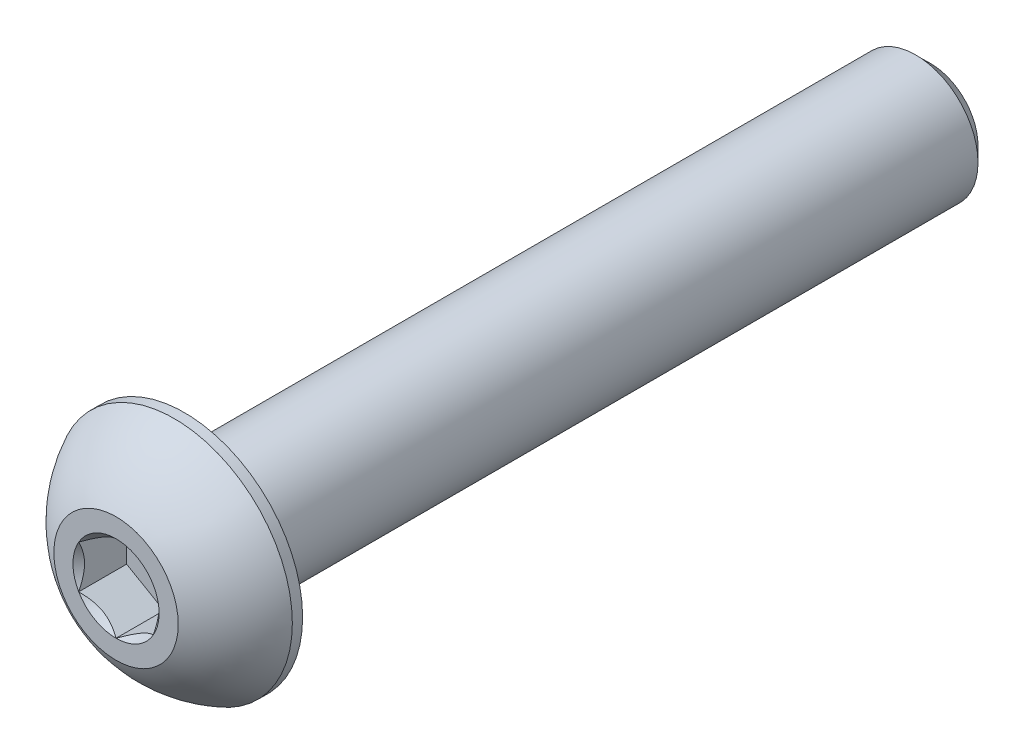
ISO-10303-21;
HEADER;
FILE_DESCRIPTION(('STEP AP214'),'2;1');
FILE_NAME('part.step','',(''),(''),'','','');
FILE_SCHEMA(('AUTOMOTIVE_DESIGN { 1 0 10303 214 1 1 1 1 }'));
ENDSEC;
DATA;
#1=APPLICATION_CONTEXT('core data for automotive mechanical design processes');
#2=APPLICATION_PROTOCOL_DEFINITION('international standard','automotive_design',2000,#1);
#3=PRODUCT_CONTEXT('',#1,'mechanical');
#4=PRODUCT('Part','Part','',(#3));
#5=PRODUCT_RELATED_PRODUCT_CATEGORY('part','',(#4));
#6=PRODUCT_DEFINITION_FORMATION('','',#4);
#7=PRODUCT_DEFINITION_CONTEXT('part definition',#1,'design');
#8=PRODUCT_DEFINITION('design','',#6,#7);
#9=PRODUCT_DEFINITION_SHAPE('','',#8);
#10=(LENGTH_UNIT() NAMED_UNIT(*) SI_UNIT(.MILLI.,.METRE.));
#11=(NAMED_UNIT(*) PLANE_ANGLE_UNIT() SI_UNIT($,.RADIAN.));
#12=(NAMED_UNIT(*) SI_UNIT($,.STERADIAN.) SOLID_ANGLE_UNIT());
#13=UNCERTAINTY_MEASURE_WITH_UNIT(LENGTH_MEASURE(1.E-05),#10,'distance_accuracy_value','');
#14=(GEOMETRIC_REPRESENTATION_CONTEXT(3) GLOBAL_UNCERTAINTY_ASSIGNED_CONTEXT((#13)) GLOBAL_UNIT_ASSIGNED_CONTEXT((#10,
#11,#12)) REPRESENTATION_CONTEXT('',''));
#15=CARTESIAN_POINT('',(0.,0.,0.));
#16=DIRECTION('',(0.,0.,1.));
#17=DIRECTION('',(1.,0.,0.));
#18=AXIS2_PLACEMENT_3D('',#15,#16,#17);
#19=CARTESIAN_POINT('',(0.,0.,-32.75));
#20=DIRECTION('',(0.,0.,1.));
#21=DIRECTION('',(1.,0.,0.));
#22=AXIS2_PLACEMENT_3D('',#19,#20,#21);
#23=PLANE('',#22);
#24=CARTESIAN_POINT('',(0.,0.,-32.75));
#25=DIRECTION('',(0.,0.,1.));
#26=DIRECTION('',(1.,0.,0.));
#27=AXIS2_PLACEMENT_3D('',#24,#25,#26);
#28=CIRCLE('',#27,1.9);
#29=CARTESIAN_POINT('',(1.9,0.,-32.75));
#30=VERTEX_POINT('',#29);
#31=EDGE_CURVE('E55',#30,#30,#28,.T.);
#32=ORIENTED_EDGE('',*,*,#31,.F.);
#33=EDGE_LOOP('',(#32));
#34=FACE_BOUND('',#33,.T.);
#35=ADVANCED_FACE('F41',(#34),#23,.F.);
#36=CARTESIAN_POINT('',(0.,0.,-32.75));
#37=DIRECTION('',(0.,0.,1.));
#38=DIRECTION('',(1.,0.,0.));
#39=AXIS2_PLACEMENT_3D('',#36,#37,#38);
#40=CONICAL_SURFACE('',#39,1.9,0.785398163397446);
#41=CARTESIAN_POINT('',(0.,0.,-32.15));
#42=DIRECTION('',(0.,0.,1.));
#43=DIRECTION('',(1.,0.,0.));
#44=AXIS2_PLACEMENT_3D('',#41,#42,#43);
#45=CIRCLE('',#44,2.5);
#46=CARTESIAN_POINT('',(2.5,0.,-32.15));
#47=VERTEX_POINT('',#46);
#48=EDGE_CURVE('E198',#47,#47,#45,.T.);
#49=ORIENTED_EDGE('',*,*,#48,.F.);
#50=EDGE_LOOP('',(#49));
#51=FACE_BOUND('',#50,.T.);
#52=ORIENTED_EDGE('',*,*,#31,.T.);
#53=EDGE_LOOP('',(#52));
#54=FACE_BOUND('',#53,.T.);
#55=ADVANCED_FACE('F205',(#51,#54),#40,.T.);
#56=CARTESIAN_POINT('',(0.,0.,0.));
#57=DIRECTION('',(0.,0.,1.));
#58=DIRECTION('',(1.,0.,0.));
#59=AXIS2_PLACEMENT_3D('',#56,#57,#58);
#60=CYLINDRICAL_SURFACE('',#59,2.50000000000001);
#61=CARTESIAN_POINT('',(0.,0.,-2.75));
#62=DIRECTION('',(0.,0.,1.));
#63=DIRECTION('',(1.,0.,0.));
#64=AXIS2_PLACEMENT_3D('',#61,#62,#63);
#65=CIRCLE('',#64,2.50000000000001);
#66=CARTESIAN_POINT('',(2.50000000000001,0.,-2.75));
#67=VERTEX_POINT('',#66);
#68=EDGE_CURVE('E194',#67,#67,#65,.T.);
#69=ORIENTED_EDGE('',*,*,#68,.F.);
#70=EDGE_LOOP('',(#69));
#71=FACE_BOUND('',#70,.T.);
#72=ORIENTED_EDGE('',*,*,#48,.T.);
#73=EDGE_LOOP('',(#72));
#74=FACE_BOUND('',#73,.T.);
#75=ADVANCED_FACE('F211',(#71,#74),#60,.T.);
#76=CARTESIAN_POINT('',(0.,-4.75,-2.75));
#77=DIRECTION('',(0.,0.,1.));
#78=DIRECTION('',(1.,0.,0.));
#79=AXIS2_PLACEMENT_3D('',#76,#77,#78);
#80=PLANE('',#79);
#81=CARTESIAN_POINT('',(0.,0.,-2.75));
#82=DIRECTION('',(0.,0.,1.));
#83=DIRECTION('',(1.,0.,0.));
#84=AXIS2_PLACEMENT_3D('',#81,#82,#83);
#85=CIRCLE('',#84,4.75);
#86=CARTESIAN_POINT('',(4.75,0.,-2.75));
#87=VERTEX_POINT('',#86);
#88=EDGE_CURVE('E186',#87,#87,#85,.T.);
#89=ORIENTED_EDGE('',*,*,#88,.F.);
#90=EDGE_LOOP('',(#89));
#91=FACE_BOUND('',#90,.T.);
#92=ORIENTED_EDGE('',*,*,#68,.T.);
#93=EDGE_LOOP('',(#92));
#94=FACE_BOUND('',#93,.T.);
#95=ADVANCED_FACE('F216',(#91,#94),#80,.F.);
#96=CARTESIAN_POINT('',(0.,0.,-4.65805481283422));
#97=DIRECTION('',(0.,0.,1.));
#98=DIRECTION('',(0.,-1.,0.));
#99=AXIS2_PLACEMENT_3D('',#96,#97,#98);
#100=SPHERICAL_SURFACE('',#99,5.28653711226623);
#101=CARTESIAN_POINT('',(0.,0.,0.));
#102=DIRECTION('',(0.,0.,1.));
#103=DIRECTION('',(1.,0.,0.));
#104=AXIS2_PLACEMENT_3D('',#101,#102,#103);
#105=CIRCLE('',#104,2.50000000000001);
#106=CARTESIAN_POINT('',(2.50000000000001,0.,0.));
#107=VERTEX_POINT('',#106);
#108=EDGE_CURVE('E190',#107,#107,#105,.T.);
#109=ORIENTED_EDGE('',*,*,#108,.F.);
#110=EDGE_LOOP('',(#109));
#111=FACE_BOUND('',#110,.T.);
#112=CARTESIAN_POINT('',(0.,0.,-2.3375));
#113=DIRECTION('',(0.,0.,1.));
#114=DIRECTION('',(1.,0.,0.));
#115=AXIS2_PLACEMENT_3D('',#112,#113,#114);
#116=CIRCLE('',#115,4.75);
#117=CARTESIAN_POINT('',(4.75,0.,-2.3375));
#118=VERTEX_POINT('',#117);
#119=EDGE_CURVE('E182',#118,#118,#116,.T.);
#120=ORIENTED_EDGE('',*,*,#119,.T.);
#121=EDGE_LOOP('',(#120));
#122=FACE_BOUND('',#121,.T.);
#123=ADVANCED_FACE('F221',(#111,#122),#100,.T.);
#124=CARTESIAN_POINT('',(0.,-2.50000000000001,0.));
#125=DIRECTION('',(0.,0.,-1.));
#126=DIRECTION('',(-1.,0.,0.));
#127=AXIS2_PLACEMENT_3D('',#124,#125,#126);
#128=PLANE('',#127);
#129=CARTESIAN_POINT('',(0.,0.,0.));
#130=DIRECTION('',(0.,0.,1.));
#131=DIRECTION('',(1.,0.,0.));
#132=AXIS2_PLACEMENT_3D('',#129,#130,#131);
#133=CIRCLE('',#132,1.73205080756888);
#134=CARTESIAN_POINT('',(-1.5,0.866025403784438,0.));
#135=VERTEX_POINT('',#134);
#136=CARTESIAN_POINT('',(-1.5,-0.866025403784439,0.));
#137=VERTEX_POINT('',#136);
#138=EDGE_CURVE('E68',#135,#137,#133,.T.);
#139=ORIENTED_EDGE('',*,*,#138,.F.);
#140=CARTESIAN_POINT('',(0.,1.73205080756888,0.));
#141=VERTEX_POINT('',#140);
#142=EDGE_CURVE('E145',#141,#135,#133,.T.);
#143=ORIENTED_EDGE('',*,*,#142,.F.);
#144=CARTESIAN_POINT('',(1.5,0.866025403784435,0.));
#145=VERTEX_POINT('',#144);
#146=EDGE_CURVE('E140',#145,#141,#133,.T.);
#147=ORIENTED_EDGE('',*,*,#146,.F.);
#148=CARTESIAN_POINT('',(1.5,-0.866025403784436,0.));
#149=VERTEX_POINT('',#148);
#150=EDGE_CURVE('E109',#149,#145,#133,.T.);
#151=ORIENTED_EDGE('',*,*,#150,.F.);
#152=CARTESIAN_POINT('',(0.,-1.73205080756888,0.));
#153=VERTEX_POINT('',#152);
#154=EDGE_CURVE('E100',#153,#149,#133,.T.);
#155=ORIENTED_EDGE('',*,*,#154,.F.);
#156=EDGE_CURVE('E61',#137,#153,#133,.T.);
#157=ORIENTED_EDGE('',*,*,#156,.F.);
#158=EDGE_LOOP('',(#139,#143,#147,#151,#155,#157));
#159=FACE_BOUND('',#158,.T.);
#160=ORIENTED_EDGE('',*,*,#108,.T.);
#161=EDGE_LOOP('',(#160));
#162=FACE_BOUND('',#161,.T.);
#163=ADVANCED_FACE('F137',(#159,#162),#128,.F.);
#164=CARTESIAN_POINT('',(0.,0.,0.));
#165=DIRECTION('',(0.,0.,1.));
#166=DIRECTION('',(1.,0.,0.));
#167=AXIS2_PLACEMENT_3D('',#164,#165,#166);
#168=CYLINDRICAL_SURFACE('',#167,4.75);
#169=ORIENTED_EDGE('',*,*,#119,.F.);
#170=EDGE_LOOP('',(#169));
#171=FACE_BOUND('',#170,.T.);
#172=ORIENTED_EDGE('',*,*,#88,.T.);
#173=EDGE_LOOP('',(#172));
#174=FACE_BOUND('',#173,.T.);
#175=ADVANCED_FACE('F227',(#171,#174),#168,.T.);
#176=CARTESIAN_POINT('',(0.,0.,0.));
#177=DIRECTION('',(0.,0.,1.));
#178=DIRECTION('',(1.,0.,0.));
#179=AXIS2_PLACEMENT_3D('',#176,#177,#178);
#180=CONICAL_SURFACE('',#179,1.73205080756888,0.78539816339745);
#181=ORIENTED_EDGE('',*,*,#150,.T.);
#182=CARTESIAN_POINT('',(1.5,-1.72720812969692,0.555578516270788));
#183=CARTESIAN_POINT('',(1.5,-1.68515175699267,0.523829907857423));
#184=CARTESIAN_POINT('',(1.5,-1.64286104748673,0.49239259380738));
#185=CARTESIAN_POINT('',(1.5,-1.55771581035941,0.430269087556407));
#186=CARTESIAN_POINT('',(1.5,-1.51486114386668,0.3995830858922));
#187=CARTESIAN_POINT('',(1.5,-1.3846813415127,0.308407192427159));
#188=CARTESIAN_POINT('',(1.5,-1.29637976071653,0.249288343426771));
#189=CARTESIAN_POINT('',(1.5,-1.11121478730467,0.133230996316503));
#190=CARTESIAN_POINT('',(1.5,-1.01415038238167,0.0766095587330072));
#191=CARTESIAN_POINT('',(1.5,-0.815173408897602,-0.0269631187343471));
#192=CARTESIAN_POINT('',(1.5,-0.713278669253282,-0.0739469584583303));
#193=CARTESIAN_POINT('',(1.5,-0.560333774943109,-0.13142733156917));
#194=CARTESIAN_POINT('',(1.5,-0.51154798294804,-0.14792461224275));
#195=CARTESIAN_POINT('',(1.5,-0.412798620136864,-0.177002487072995));
#196=CARTESIAN_POINT('',(1.5,-0.36283496843756,-0.18958281140598));
#197=CARTESIAN_POINT('',(1.5,-0.26286323544498,-0.209963805853229));
#198=CARTESIAN_POINT('',(1.5,-0.212872113808021,-0.217846367254018));
#199=CARTESIAN_POINT('',(1.5,-0.112355243569544,-0.228677936030995));
#200=CARTESIAN_POINT('',(1.5,-0.0618295883726266,-0.231627791475648));
#201=CARTESIAN_POINT('',(1.5,0.0374291733323851,-0.232375142275149));
#202=CARTESIAN_POINT('',(1.5,0.0861609672002999,-0.230355266441923));
#203=CARTESIAN_POINT('',(1.5,0.183206937768828,-0.22167744710324));
#204=CARTESIAN_POINT('',(1.5,0.231521073438269,-0.215019053031542));
#205=CARTESIAN_POINT('',(1.5,0.328199853425436,-0.197314755877431));
#206=CARTESIAN_POINT('',(1.5,0.376550616310328,-0.18619418874296));
#207=CARTESIAN_POINT('',(1.5,0.472195697125599,-0.160156585951287));
#208=CARTESIAN_POINT('',(1.5,0.519490103092741,-0.145239867959063));
#209=CARTESIAN_POINT('',(1.5,0.668391282696625,-0.0926647764039259));
#210=CARTESIAN_POINT('',(1.5,0.767878709508553,-0.0490187125280229));
#211=CARTESIAN_POINT('',(1.5,0.962179866690724,0.0480229945930991));
#212=CARTESIAN_POINT('',(1.5,1.05697519961444,0.101453665089536));
#213=CARTESIAN_POINT('',(1.5,1.23814273533383,0.21168585200456));
#214=CARTESIAN_POINT('',(1.5,1.3246994218129,0.268187920698598));
#215=CARTESIAN_POINT('',(1.5,1.45222331290673,0.355534301578662));
#216=CARTESIAN_POINT('',(1.5,1.49418091978756,0.384957758680046));
#217=CARTESIAN_POINT('',(1.5,1.57752272931476,0.444582821830467));
#218=CARTESIAN_POINT('',(1.5,1.61890708647354,0.47478421166444));
#219=CARTESIAN_POINT('',(1.5,1.66005278019494,0.505308178609459));
#220=B_SPLINE_CURVE_WITH_KNOTS('',3,(#182,#183,#184,#185,#186,#187,#188,#189,#190,#191,#192,
#193,#194,#195,#196,#197,#198,#199,#200,#201,#202,#203,#204,#205,#206,#207,#208,#209,#210,#211,
#212,#213,#214,#215,#216,#217,#218,#219),.UNSPECIFIED.,.F.,.F.,(4,2,2,2,2,2,2,2,2,2,2,2,2,2,2,2,
2,2,4),(0.,0.158079548982668,0.316198780993941,0.634850417346956,0.971690311361506,
1.30737131660666,1.46173961127088,1.61611853740677,1.76772101421409,1.91929742368537,
2.065387412096,2.21149159305544,2.36014984633872,2.50879566386709,2.83376031422673,
3.15991186985651,3.46985601802197,3.62358896039973,3.7772796264207),.UNSPECIFIED.);
#221=EDGE_CURVE('E11',#149,#145,#220,.T.);
#222=ORIENTED_EDGE('',*,*,#221,.F.);
#223=EDGE_LOOP('',(#181,#222));
#224=FACE_BOUND('',#223,.T.);
#225=ADVANCED_FACE('F113',(#224),#180,.F.);
#226=ORIENTED_EDGE('',*,*,#146,.T.);
#227=CARTESIAN_POINT('',(1.5002,0.8659099337306,0.000115481600074659));
#228=CARTESIAN_POINT('',(1.44863220926292,0.895682611594165,-0.029634523932671));
#229=CARTESIAN_POINT('',(1.3962020823348,0.925953159489764,-0.0576375160896862));
#230=CARTESIAN_POINT('',(1.2892909659444,0.987678321317122,-0.108910769559856));
#231=CARTESIAN_POINT('',(1.23479980418534,1.01913880822717,-0.132152494955626));
#232=CARTESIAN_POINT('',(1.12492091864275,1.08257741237344,-0.171966271007779));
#233=CARTESIAN_POINT('',(1.0695611909048,1.11453936608521,-0.188638414329103));
#234=CARTESIAN_POINT('',(0.957622742522849,1.1791670593912,-0.214325543181896));
#235=CARTESIAN_POINT('',(0.901047443446991,1.21183082354213,-0.223359709521133));
#236=CARTESIAN_POINT('',(0.803544610483559,1.26812411040032,-0.231510918773147));
#237=CARTESIAN_POINT('',(0.762743091719533,1.29168087824208,-0.232717747010783));
#238=CARTESIAN_POINT('',(0.681212030384141,1.33875285845138,-0.230685942837732));
#239=CARTESIAN_POINT('',(0.640482505685369,1.36226806050018,-0.227446329251692));
#240=CARTESIAN_POINT('',(0.559415597836583,1.40907206156905,-0.216708014018038));
#241=CARTESIAN_POINT('',(0.519078615401711,1.43236062923612,-0.209205346981266));
#242=CARTESIAN_POINT('',(0.439081663085969,1.47854689118996,-0.190348388071709));
#243=CARTESIAN_POINT('',(0.399421991483792,1.50144441326545,-0.178992442981415));
#244=CARTESIAN_POINT('',(0.297836865225515,1.56009461325633,-0.145278352407328));
#245=CARTESIAN_POINT('',(0.236541446290311,1.59548353987866,-0.120378150906632));
#246=CARTESIAN_POINT('',(0.146414371536687,1.64751843074894,-0.0783433467284234));
#247=CARTESIAN_POINT('',(0.116714860092283,1.66466545167617,-0.0635748464409036));
#248=CARTESIAN_POINT('',(0.0578620986162495,1.69864410935691,-0.0326894340598312));
#249=CARTESIAN_POINT('',(0.0287085957793633,1.7154758920676,-0.0165731658782895));
#250=CARTESIAN_POINT('',(-0.000199999999999511,1.73216627762271,0.000115481600073514));
#251=B_SPLINE_CURVE_WITH_KNOTS('',3,(#227,#228,#229,#230,#231,#232,#233,#234,#235,#236,#237,
#238,#239,#240,#241,#242,#243,#244,#245,#246,#247,#248,#249,#250),.UNSPECIFIED.,.F.,.F.,(4,2,2,
2,2,2,2,2,2,2,2,4),(0.,0.199829143693305,0.400822987382389,0.598623720538181,0.79592624018889,
0.937113067959882,1.07833105577193,1.21968061668222,1.36109089931054,1.58570969637565,
1.69770705470964,1.80965120737194),.UNSPECIFIED.);
#252=EDGE_CURVE('E144',#145,#141,#251,.T.);
#253=ORIENTED_EDGE('',*,*,#252,.F.);
#254=EDGE_LOOP('',(#226,#253));
#255=FACE_BOUND('',#254,.T.);
#256=ADVANCED_FACE('F323',(#255),#180,.F.);
#257=ORIENTED_EDGE('',*,*,#142,.T.);
#258=CARTESIAN_POINT('',(0.000200000000000433,1.73216627762271,0.000115481600073662));
#259=CARTESIAN_POINT('',(-0.0513677907370754,1.70239359975915,-0.0296345239326721));
#260=CARTESIAN_POINT('',(-0.1037979176652,1.67212305186355,-0.0576375160896873));
#261=CARTESIAN_POINT('',(-0.210709034055596,1.61039789003619,-0.108910769559857));
#262=CARTESIAN_POINT('',(-0.265200195814661,1.57893740312614,-0.132152494955627));
#263=CARTESIAN_POINT('',(-0.375079081357248,1.51549879897987,-0.17196627100778));
#264=CARTESIAN_POINT('',(-0.430438809095199,1.4835368452681,-0.188638414329104));
#265=CARTESIAN_POINT('',(-0.54237725747715,1.41890915196211,-0.214325543181897));
#266=CARTESIAN_POINT('',(-0.598952556553008,1.38624538781118,-0.223359709521134));
#267=CARTESIAN_POINT('',(-0.696455389516441,1.32995210095299,-0.231510918773148));
#268=CARTESIAN_POINT('',(-0.737256908280466,1.30639533311124,-0.232717747010783));
#269=CARTESIAN_POINT('',(-0.818787969615858,1.25932335290193,-0.230685942837733));
#270=CARTESIAN_POINT('',(-0.85951749431463,1.23580815085313,-0.227446329251692));
#271=CARTESIAN_POINT('',(-0.940584402163416,1.18900414978426,-0.216708014018038));
#272=CARTESIAN_POINT('',(-0.980921384598288,1.16571558211719,-0.209205346981267));
#273=CARTESIAN_POINT('',(-1.06091833691403,1.11952932016335,-0.190348388071709));
#274=CARTESIAN_POINT('',(-1.10057800851621,1.09663179808786,-0.178992442981415));
#275=CARTESIAN_POINT('',(-1.20216313477448,1.03798159809698,-0.145278352407328));
#276=CARTESIAN_POINT('',(-1.26345855370969,1.00259267147465,-0.120378150906633));
#277=CARTESIAN_POINT('',(-1.35358562846331,0.950557780604373,-0.0783433467284238));
#278=CARTESIAN_POINT('',(-1.38328513990772,0.933410759677146,-0.063574846440904));
#279=CARTESIAN_POINT('',(-1.44213790138375,0.899432101996406,-0.0326894340598315));
#280=CARTESIAN_POINT('',(-1.47129140422064,0.882600319285709,-0.0165731658782898));
#281=CARTESIAN_POINT('',(-1.5002,0.8659099337306,0.000115481600073161));
#282=B_SPLINE_CURVE_WITH_KNOTS('',3,(#258,#259,#260,#261,#262,#263,#264,#265,#266,#267,#268,
#269,#270,#271,#272,#273,#274,#275,#276,#277,#278,#279,#280,#281),.UNSPECIFIED.,.F.,.F.,(4,2,2,
2,2,2,2,2,2,2,2,4),(0.,0.199829143693305,0.400822987382389,0.598623720538181,0.79592624018889,
0.937113067959882,1.07833105577193,1.21968061668222,1.36109089931054,1.58570969637565,
1.69770705470963,1.80965120737193),.UNSPECIFIED.);
#283=EDGE_CURVE('E151',#141,#135,#282,.T.);
#284=ORIENTED_EDGE('',*,*,#283,.F.);
#285=EDGE_LOOP('',(#257,#284));
#286=FACE_BOUND('',#285,.T.);
#287=ADVANCED_FACE('F156',(#286),#180,.F.);
#288=ORIENTED_EDGE('',*,*,#138,.T.);
#289=CARTESIAN_POINT('',(-1.5,-1.72720812969692,0.55557851627079));
#290=CARTESIAN_POINT('',(-1.5,-1.68515175699268,0.523829907857425));
#291=CARTESIAN_POINT('',(-1.5,-1.64286104748673,0.492392593807382));
#292=CARTESIAN_POINT('',(-1.5,-1.55771581035942,0.430269087556408));
#293=CARTESIAN_POINT('',(-1.5,-1.51486114386668,0.399583085892201));
#294=CARTESIAN_POINT('',(-1.5,-1.3846813415127,0.30840719242716));
#295=CARTESIAN_POINT('',(-1.5,-1.29637976071654,0.249288343426772));
#296=CARTESIAN_POINT('',(-1.5,-1.11121478730467,0.133230996316504));
#297=CARTESIAN_POINT('',(-1.5,-1.01415038238167,0.0766095587330075));
#298=CARTESIAN_POINT('',(-1.5,-0.815173408897605,-0.0269631187343474));
#299=CARTESIAN_POINT('',(-1.5,-0.713278669253285,-0.0739469584583307));
#300=CARTESIAN_POINT('',(-1.5,-0.560333774943112,-0.13142733156917));
#301=CARTESIAN_POINT('',(-1.5,-0.511547982948042,-0.147924612242751));
#302=CARTESIAN_POINT('',(-1.5,-0.412798620136867,-0.177002487072996));
#303=CARTESIAN_POINT('',(-1.5,-0.362834968437563,-0.189582811405981));
#304=CARTESIAN_POINT('',(-1.5,-0.262863235444982,-0.20996380585323));
#305=CARTESIAN_POINT('',(-1.5,-0.212872113808023,-0.21784636725402));
#306=CARTESIAN_POINT('',(-1.5,-0.112355243569546,-0.228677936030997));
#307=CARTESIAN_POINT('',(-1.5,-0.0618295883726285,-0.231627791475649));
#308=CARTESIAN_POINT('',(-1.5,0.0374291733323832,-0.23237514227515));
#309=CARTESIAN_POINT('',(-1.5,0.086160967200298,-0.230355266441925));
#310=CARTESIAN_POINT('',(-1.5,0.183206937768826,-0.221677447103242));
#311=CARTESIAN_POINT('',(-1.5,0.231521073438268,-0.215019053031544));
#312=CARTESIAN_POINT('',(-1.5,0.328199853425435,-0.197314755877433));
#313=CARTESIAN_POINT('',(-1.5,0.376550616310327,-0.186194188742962));
#314=CARTESIAN_POINT('',(-1.5,0.472195697125597,-0.160156585951289));
#315=CARTESIAN_POINT('',(-1.5,0.519490103092739,-0.145239867959065));
#316=CARTESIAN_POINT('',(-1.5,0.668391282696623,-0.0926647764039278));
#317=CARTESIAN_POINT('',(-1.5,0.767878709508551,-0.0490187125280251));
#318=CARTESIAN_POINT('',(-1.5,0.962179866690722,0.0480229945930965));
#319=CARTESIAN_POINT('',(-1.5,1.05697519961444,0.101453665089533));
#320=CARTESIAN_POINT('',(-1.5,1.23814273533382,0.211685852004557));
#321=CARTESIAN_POINT('',(-1.5,1.32469942181289,0.268187920698595));
#322=CARTESIAN_POINT('',(-1.5,1.45222331290673,0.355534301578658));
#323=CARTESIAN_POINT('',(-1.5,1.49418091978755,0.384957758680042));
#324=CARTESIAN_POINT('',(-1.5,1.57752272931476,0.444582821830462));
#325=CARTESIAN_POINT('',(-1.5,1.61890708647354,0.474784211664436));
#326=CARTESIAN_POINT('',(-1.5,1.66005278019494,0.505308178609454));
#327=B_SPLINE_CURVE_WITH_KNOTS('',3,(#289,#290,#291,#292,#293,#294,#295,#296,#297,#298,#299,
#300,#301,#302,#303,#304,#305,#306,#307,#308,#309,#310,#311,#312,#313,#314,#315,#316,#317,#318,
#319,#320,#321,#322,#323,#324,#325,#326),.UNSPECIFIED.,.F.,.F.,(4,2,2,2,2,2,2,2,2,2,2,2,2,2,2,2,
2,2,4),(0.,0.158079548982668,0.316198780993941,0.634850417346957,0.971690311361509,
1.30737131660667,1.46173961127088,1.61611853740677,1.76772101421409,1.91929742368538,
2.065387412096,2.21149159305544,2.36014984633872,2.50879566386709,2.83376031422673,
3.15991186985651,3.46985601802197,3.62358896039973,3.7772796264207),.UNSPECIFIED.);
#328=EDGE_CURVE('E161',#135,#137,#327,.F.);
#329=ORIENTED_EDGE('',*,*,#328,.F.);
#330=EDGE_LOOP('',(#288,#329));
#331=FACE_BOUND('',#330,.T.);
#332=ADVANCED_FACE('F317',(#331),#180,.F.);
#333=ORIENTED_EDGE('',*,*,#156,.T.);
#334=CARTESIAN_POINT('',(-1.5002,-0.8659099337306,0.000115481600073141));
#335=CARTESIAN_POINT('',(-1.44863220926292,-0.895682611594165,-0.0296345239326726));
#336=CARTESIAN_POINT('',(-1.3962020823348,-0.925953159489764,-0.0576375160896876));
#337=CARTESIAN_POINT('',(-1.2892909659444,-0.987678321317123,-0.108910769559857));
#338=CARTESIAN_POINT('',(-1.23479980418534,-1.01913880822717,-0.132152494955627));
#339=CARTESIAN_POINT('',(-1.12492091864275,-1.08257741237344,-0.17196627100778));
#340=CARTESIAN_POINT('',(-1.0695611909048,-1.11453936608521,-0.188638414329104));
#341=CARTESIAN_POINT('',(-0.957622742522848,-1.1791670593912,-0.214325543181897));
#342=CARTESIAN_POINT('',(-0.90104744344699,-1.21183082354213,-0.223359709521134));
#343=CARTESIAN_POINT('',(-0.803544610483558,-1.26812411040032,-0.231510918773148));
#344=CARTESIAN_POINT('',(-0.762743091719533,-1.29168087824208,-0.232717747010783));
#345=CARTESIAN_POINT('',(-0.681212030384141,-1.33875285845138,-0.230685942837732));
#346=CARTESIAN_POINT('',(-0.640482505685369,-1.36226806050018,-0.227446329251692));
#347=CARTESIAN_POINT('',(-0.559415597836583,-1.40907206156905,-0.216708014018038));
#348=CARTESIAN_POINT('',(-0.519078615401711,-1.43236062923612,-0.209205346981267));
#349=CARTESIAN_POINT('',(-0.439081663085968,-1.47854689118996,-0.190348388071709));
#350=CARTESIAN_POINT('',(-0.399421991483791,-1.50144441326545,-0.178992442981415));
#351=CARTESIAN_POINT('',(-0.297836865225515,-1.56009461325633,-0.145278352407328));
#352=CARTESIAN_POINT('',(-0.236541446290311,-1.59548353987866,-0.120378150906633));
#353=CARTESIAN_POINT('',(-0.146414371536687,-1.64751843074894,-0.0783433467284239));
#354=CARTESIAN_POINT('',(-0.116714860092283,-1.66466545167617,-0.0635748464409041));
#355=CARTESIAN_POINT('',(-0.0578620986162496,-1.69864410935691,-0.0326894340598317));
#356=CARTESIAN_POINT('',(-0.0287085957793635,-1.7154758920676,-0.01657316587829));
#357=CARTESIAN_POINT('',(0.000199999999999168,-1.73216627762271,0.000115481600072962));
#358=B_SPLINE_CURVE_WITH_KNOTS('',3,(#334,#335,#336,#337,#338,#339,#340,#341,#342,#343,#344,
#345,#346,#347,#348,#349,#350,#351,#352,#353,#354,#355,#356,#357),.UNSPECIFIED.,.F.,.F.,(4,2,2,
2,2,2,2,2,2,2,2,4),(0.,0.199829143693304,0.400822987382388,0.59862372053818,0.795926240188888,
0.93711306795988,1.07833105577193,1.21968061668222,1.36109089931054,1.58570969637565,
1.69770705470963,1.80965120737193),.UNSPECIFIED.);
#359=EDGE_CURVE('E126',#137,#153,#358,.T.);
#360=ORIENTED_EDGE('',*,*,#359,.F.);
#361=EDGE_LOOP('',(#333,#360));
#362=FACE_BOUND('',#361,.T.);
#363=ADVANCED_FACE('F256',(#362),#180,.F.);
#364=ORIENTED_EDGE('',*,*,#154,.T.);
#365=CARTESIAN_POINT('',(-0.00020000000000076,-1.73216627762271,0.000115481600073012));
#366=CARTESIAN_POINT('',(0.051367790737075,-1.70239359975915,-0.0296345239326725));
#367=CARTESIAN_POINT('',(0.1037979176652,-1.67212305186355,-0.0576375160896876));
#368=CARTESIAN_POINT('',(0.210709034055596,-1.61039789003619,-0.108910769559858));
#369=CARTESIAN_POINT('',(0.26520019581466,-1.57893740312614,-0.132152494955628));
#370=CARTESIAN_POINT('',(0.375079081357247,-1.51549879897987,-0.171966271007781));
#371=CARTESIAN_POINT('',(0.430438809095198,-1.4835368452681,-0.188638414329104));
#372=CARTESIAN_POINT('',(0.542377257477149,-1.41890915196211,-0.214325543181897));
#373=CARTESIAN_POINT('',(0.598952556553007,-1.38624538781118,-0.223359709521135));
#374=CARTESIAN_POINT('',(0.696455389516439,-1.32995210095299,-0.231510918773149));
#375=CARTESIAN_POINT('',(0.737256908280465,-1.30639533311124,-0.232717747010784));
#376=CARTESIAN_POINT('',(0.818787969615857,-1.25932335290193,-0.230685942837733));
#377=CARTESIAN_POINT('',(0.859517494314628,-1.23580815085313,-0.227446329251693));
#378=CARTESIAN_POINT('',(0.940584402163414,-1.18900414978426,-0.216708014018039));
#379=CARTESIAN_POINT('',(0.980921384598286,-1.16571558211719,-0.209205346981268));
#380=CARTESIAN_POINT('',(1.06091833691403,-1.11952932016335,-0.19034838807171));
#381=CARTESIAN_POINT('',(1.10057800851621,-1.09663179808786,-0.178992442981416));
#382=CARTESIAN_POINT('',(1.20216313477448,-1.03798159809698,-0.145278352407329));
#383=CARTESIAN_POINT('',(1.26345855370969,-1.00259267147465,-0.120378150906634));
#384=CARTESIAN_POINT('',(1.35358562846331,-0.950557780604372,-0.0783433467284242));
#385=CARTESIAN_POINT('',(1.38328513990772,-0.933410759677145,-0.0635748464409042));
#386=CARTESIAN_POINT('',(1.44213790138375,-0.899432101996404,-0.0326894340598314));
#387=CARTESIAN_POINT('',(1.47129140422064,-0.882600319285707,-0.0165731658782896));
#388=CARTESIAN_POINT('',(1.5002,-0.865909933730598,0.000115481600073517));
#389=B_SPLINE_CURVE_WITH_KNOTS('',3,(#365,#366,#367,#368,#369,#370,#371,#372,#373,#374,#375,
#376,#377,#378,#379,#380,#381,#382,#383,#384,#385,#386,#387,#388),.UNSPECIFIED.,.F.,.F.,(4,2,2,
2,2,2,2,2,2,2,2,4),(0.,0.199829143693305,0.400822987382388,0.59862372053818,0.795926240188889,
0.937113067959881,1.07833105577193,1.21968061668222,1.36109089931054,1.58570969637565,
1.69770705470964,1.80965120737194),.UNSPECIFIED.);
#390=EDGE_CURVE('E104',#153,#149,#389,.T.);
#391=ORIENTED_EDGE('',*,*,#390,.F.);
#392=EDGE_LOOP('',(#364,#391));
#393=FACE_BOUND('',#392,.T.);
#394=ADVANCED_FACE('F102',(#393),#180,.F.);
#395=CARTESIAN_POINT('',(1.5,-0.866025403784436,-1.925));
#396=DIRECTION('',(0.,0.,1.));
#397=DIRECTION('',(1.,0.,0.));
#398=AXIS2_PLACEMENT_3D('',#395,#396,#397);
#399=PLANE('',#398);
#400=DIRECTION('',(0.866025403784438,0.5,0.));
#401=VECTOR('',#400,1.);
#402=CARTESIAN_POINT('',(0.,-1.73205080756888,-1.925));
#403=LINE('',#402,#401);
#404=CARTESIAN_POINT('',(0.,-1.73205080756888,-1.925));
#405=VERTEX_POINT('',#404);
#406=CARTESIAN_POINT('',(1.5,-0.866025403784436,-1.925));
#407=VERTEX_POINT('',#406);
#408=EDGE_CURVE('E125',#405,#407,#403,.T.);
#409=ORIENTED_EDGE('',*,*,#408,.T.);
#410=DIRECTION('',(0.,1.,0.));
#411=VECTOR('',#410,1.);
#412=CARTESIAN_POINT('',(1.5,-0.866025403784436,-1.925));
#413=LINE('',#412,#411);
#414=CARTESIAN_POINT('',(1.5,0.866025403784438,-1.925));
#415=VERTEX_POINT('',#414);
#416=EDGE_CURVE('E130',#407,#415,#413,.T.);
#417=ORIENTED_EDGE('',*,*,#416,.T.);
#418=DIRECTION('',(-0.866025403784439,0.5,0.));
#419=VECTOR('',#418,1.);
#420=CARTESIAN_POINT('',(1.5,0.866025403784438,-1.925));
#421=LINE('',#420,#419);
#422=CARTESIAN_POINT('',(0.,1.73205080756888,-1.925));
#423=VERTEX_POINT('',#422);
#424=EDGE_CURVE('E301',#415,#423,#421,.T.);
#425=ORIENTED_EDGE('',*,*,#424,.T.);
#426=DIRECTION('',(-0.866025403784439,-0.5,0.));
#427=VECTOR('',#426,1.);
#428=CARTESIAN_POINT('',(0.,1.73205080756888,-1.925));
#429=LINE('',#428,#427);
#430=CARTESIAN_POINT('',(-1.5,0.866025403784438,-1.925));
#431=VERTEX_POINT('',#430);
#432=EDGE_CURVE('E170',#423,#431,#429,.T.);
#433=ORIENTED_EDGE('',*,*,#432,.T.);
#434=DIRECTION('',(0.,-1.,0.));
#435=VECTOR('',#434,1.);
#436=CARTESIAN_POINT('',(-1.5,0.866025403784438,-1.925));
#437=LINE('',#436,#435);
#438=CARTESIAN_POINT('',(-1.5,-0.866025403784438,-1.925));
#439=VERTEX_POINT('',#438);
#440=EDGE_CURVE('E307',#431,#439,#437,.T.);
#441=ORIENTED_EDGE('',*,*,#440,.T.);
#442=DIRECTION('',(0.866025403784439,-0.5,0.));
#443=VECTOR('',#442,1.);
#444=CARTESIAN_POINT('',(-1.5,-0.866025403784438,-1.925));
#445=LINE('',#444,#443);
#446=EDGE_CURVE('E134',#439,#405,#445,.T.);
#447=ORIENTED_EDGE('',*,*,#446,.T.);
#448=EDGE_LOOP('',(#409,#417,#425,#433,#441,#447));
#449=FACE_BOUND('',#448,.T.);
#450=ADVANCED_FACE('F255',(#449),#399,.T.);
#451=CARTESIAN_POINT('',(1.5,-0.866025403784436,-1.925));
#452=DIRECTION('',(1.,0.,0.));
#453=DIRECTION('',(0.,1.,0.));
#454=AXIS2_PLACEMENT_3D('',#451,#452,#453);
#455=PLANE('',#454);
#456=DIRECTION('',(0.,0.,1.));
#457=VECTOR('',#456,1.);
#458=CARTESIAN_POINT('',(1.5,-0.866025403784436,-1.925));
#459=LINE('',#458,#457);
#460=EDGE_CURVE('E121',#407,#149,#459,.T.);
#461=ORIENTED_EDGE('',*,*,#460,.T.);
#462=ORIENTED_EDGE('',*,*,#221,.T.);
#463=DIRECTION('',(0.,0.,1.));
#464=VECTOR('',#463,1.);
#465=CARTESIAN_POINT('',(1.5,0.866025403784438,-1.925));
#466=LINE('',#465,#464);
#467=EDGE_CURVE('E133',#415,#145,#466,.T.);
#468=ORIENTED_EDGE('',*,*,#467,.F.);
#469=ORIENTED_EDGE('',*,*,#416,.F.);
#470=EDGE_LOOP('',(#461,#462,#468,#469));
#471=FACE_BOUND('',#470,.T.);
#472=ADVANCED_FACE('F128',(#471),#455,.F.);
#473=CARTESIAN_POINT('',(1.5,0.866025403784438,-1.925));
#474=DIRECTION('',(0.5,0.866025403784439,0.));
#475=DIRECTION('',(-0.866025403784439,0.5,0.));
#476=AXIS2_PLACEMENT_3D('',#473,#474,#475);
#477=PLANE('',#476);
#478=ORIENTED_EDGE('',*,*,#467,.T.);
#479=ORIENTED_EDGE('',*,*,#252,.T.);
#480=DIRECTION('',(0.,0.,1.));
#481=VECTOR('',#480,1.);
#482=CARTESIAN_POINT('',(0.,1.73205080756888,-1.925));
#483=LINE('',#482,#481);
#484=EDGE_CURVE('E166',#423,#141,#483,.T.);
#485=ORIENTED_EDGE('',*,*,#484,.F.);
#486=ORIENTED_EDGE('',*,*,#424,.F.);
#487=EDGE_LOOP('',(#478,#479,#485,#486));
#488=FACE_BOUND('',#487,.T.);
#489=ADVANCED_FACE('F164',(#488),#477,.F.);
#490=CARTESIAN_POINT('',(0.,1.73205080756888,-1.925));
#491=DIRECTION('',(-0.5,0.866025403784439,0.));
#492=DIRECTION('',(-0.866025403784439,-0.5,0.));
#493=AXIS2_PLACEMENT_3D('',#490,#491,#492);
#494=PLANE('',#493);
#495=ORIENTED_EDGE('',*,*,#484,.T.);
#496=ORIENTED_EDGE('',*,*,#283,.T.);
#497=DIRECTION('',(0.,0.,1.));
#498=VECTOR('',#497,1.);
#499=CARTESIAN_POINT('',(-1.5,0.866025403784438,-1.925));
#500=LINE('',#499,#498);
#501=EDGE_CURVE('E173',#431,#135,#500,.T.);
#502=ORIENTED_EDGE('',*,*,#501,.F.);
#503=ORIENTED_EDGE('',*,*,#432,.F.);
#504=EDGE_LOOP('',(#495,#496,#502,#503));
#505=FACE_BOUND('',#504,.T.);
#506=ADVANCED_FACE('F168',(#505),#494,.F.);
#507=CARTESIAN_POINT('',(-1.5,0.866025403784438,-1.925));
#508=DIRECTION('',(-1.,0.,0.));
#509=DIRECTION('',(0.,-1.,0.));
#510=AXIS2_PLACEMENT_3D('',#507,#508,#509);
#511=PLANE('',#510);
#512=ORIENTED_EDGE('',*,*,#501,.T.);
#513=ORIENTED_EDGE('',*,*,#328,.T.);
#514=DIRECTION('',(0.,0.,1.));
#515=VECTOR('',#514,1.);
#516=CARTESIAN_POINT('',(-1.5,-0.866025403784438,-1.925));
#517=LINE('',#516,#515);
#518=EDGE_CURVE('E177',#439,#137,#517,.T.);
#519=ORIENTED_EDGE('',*,*,#518,.F.);
#520=ORIENTED_EDGE('',*,*,#440,.F.);
#521=EDGE_LOOP('',(#512,#513,#519,#520));
#522=FACE_BOUND('',#521,.T.);
#523=ADVANCED_FACE('F278',(#522),#511,.F.);
#524=CARTESIAN_POINT('',(-1.5,-0.866025403784438,-1.925));
#525=DIRECTION('',(-0.5,-0.866025403784439,0.));
#526=DIRECTION('',(0.866025403784439,-0.5,0.));
#527=AXIS2_PLACEMENT_3D('',#524,#525,#526);
#528=PLANE('',#527);
#529=ORIENTED_EDGE('',*,*,#518,.T.);
#530=ORIENTED_EDGE('',*,*,#359,.T.);
#531=DIRECTION('',(0.,0.,1.));
#532=VECTOR('',#531,1.);
#533=CARTESIAN_POINT('',(0.,-1.73205080756888,-1.925));
#534=LINE('',#533,#532);
#535=EDGE_CURVE('E123',#405,#153,#534,.T.);
#536=ORIENTED_EDGE('',*,*,#535,.F.);
#537=ORIENTED_EDGE('',*,*,#446,.F.);
#538=EDGE_LOOP('',(#529,#530,#536,#537));
#539=FACE_BOUND('',#538,.T.);
#540=ADVANCED_FACE('F236',(#539),#528,.F.);
#541=CARTESIAN_POINT('',(0.,-1.73205080756888,-1.925));
#542=DIRECTION('',(0.5,-0.866025403784438,0.));
#543=DIRECTION('',(0.866025403784439,0.5,0.));
#544=AXIS2_PLACEMENT_3D('',#541,#542,#543);
#545=PLANE('',#544);
#546=ORIENTED_EDGE('',*,*,#535,.T.);
#547=ORIENTED_EDGE('',*,*,#390,.T.);
#548=ORIENTED_EDGE('',*,*,#460,.F.);
#549=ORIENTED_EDGE('',*,*,#408,.F.);
#550=EDGE_LOOP('',(#546,#547,#548,#549));
#551=FACE_BOUND('',#550,.T.);
#552=ADVANCED_FACE('F119',(#551),#545,.F.);
#553=CLOSED_SHELL('',(#35,#55,#75,#95,#123,#163,#175,#225,#256,#287,#332,#363,#394,#450,#472,
#489,#506,#523,#540,#552));
#554=MANIFOLD_SOLID_BREP('B2',#553);
#555=ADVANCED_BREP_SHAPE_REPRESENTATION('',(#18,#554),#14);
#556=SHAPE_DEFINITION_REPRESENTATION(#9,#555);
ENDSEC;
END-ISO-10303-21;
